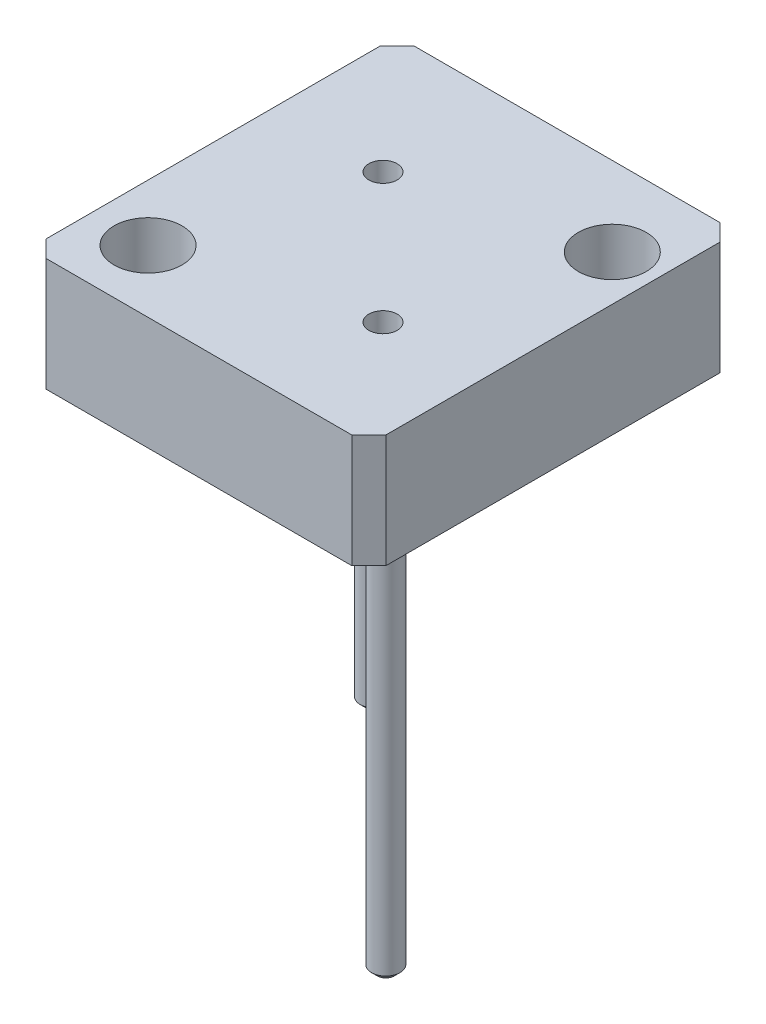
ISO-10303-21;
HEADER;
FILE_DESCRIPTION(('STEP AP214'),'2;1');
FILE_NAME('part.step','',(''),(''),'','','');
FILE_SCHEMA(('AUTOMOTIVE_DESIGN { 1 0 10303 214 1 1 1 1 }'));
ENDSEC;
DATA;
#1=APPLICATION_CONTEXT('core data for automotive mechanical design processes');
#2=APPLICATION_PROTOCOL_DEFINITION('international standard','automotive_design',2000,#1);
#3=PRODUCT_CONTEXT('',#1,'mechanical');
#4=PRODUCT('Part','Part','',(#3));
#5=PRODUCT_RELATED_PRODUCT_CATEGORY('part','',(#4));
#6=PRODUCT_DEFINITION_FORMATION('','',#4);
#7=PRODUCT_DEFINITION_CONTEXT('part definition',#1,'design');
#8=PRODUCT_DEFINITION('design','',#6,#7);
#9=PRODUCT_DEFINITION_SHAPE('','',#8);
#10=(LENGTH_UNIT() NAMED_UNIT(*) SI_UNIT(.MILLI.,.METRE.));
#11=(NAMED_UNIT(*) PLANE_ANGLE_UNIT() SI_UNIT($,.RADIAN.));
#12=(NAMED_UNIT(*) SI_UNIT($,.STERADIAN.) SOLID_ANGLE_UNIT());
#13=UNCERTAINTY_MEASURE_WITH_UNIT(LENGTH_MEASURE(1.E-05),#10,'distance_accuracy_value','');
#14=(GEOMETRIC_REPRESENTATION_CONTEXT(3) GLOBAL_UNCERTAINTY_ASSIGNED_CONTEXT((#13)) GLOBAL_UNIT_ASSIGNED_CONTEXT((#10,
#11,#12)) REPRESENTATION_CONTEXT('',''));
#15=CARTESIAN_POINT('',(0.,0.,0.));
#16=DIRECTION('',(0.,0.,1.));
#17=DIRECTION('',(1.,0.,0.));
#18=AXIS2_PLACEMENT_3D('',#15,#16,#17);
#19=CARTESIAN_POINT('',(0.,20.,0.));
#20=DIRECTION('',(1.,0.,0.));
#21=DIRECTION('',(0.,0.,-1.));
#22=AXIS2_PLACEMENT_3D('',#19,#20,#21);
#23=PLANE('',#22);
#24=DIRECTION('',(0.,0.,1.));
#25=VECTOR('',#24,1.);
#26=CARTESIAN_POINT('',(0.,0.,0.));
#27=LINE('',#26,#25);
#28=CARTESIAN_POINT('',(0.,0.,-62.));
#29=VERTEX_POINT('',#28);
#30=CARTESIAN_POINT('',(0.,0.,-3.00000000000002));
#31=VERTEX_POINT('',#30);
#32=EDGE_CURVE('E184',#29,#31,#27,.T.);
#33=ORIENTED_EDGE('',*,*,#32,.T.);
#34=DIRECTION('',(0.,1.,0.));
#35=VECTOR('',#34,1.);
#36=CARTESIAN_POINT('',(0.,20.,-3.00000000000002));
#37=LINE('',#36,#35);
#38=CARTESIAN_POINT('',(0.,20.,-3.00000000000002));
#39=VERTEX_POINT('',#38);
#40=EDGE_CURVE('E11',#31,#39,#37,.T.);
#41=ORIENTED_EDGE('',*,*,#40,.T.);
#42=DIRECTION('',(0.,0.,1.));
#43=VECTOR('',#42,1.);
#44=CARTESIAN_POINT('',(0.,20.,0.));
#45=LINE('',#44,#43);
#46=CARTESIAN_POINT('',(0.,20.,-62.));
#47=VERTEX_POINT('',#46);
#48=EDGE_CURVE('E134',#47,#39,#45,.T.);
#49=ORIENTED_EDGE('',*,*,#48,.F.);
#50=DIRECTION('',(0.,-1.,0.));
#51=VECTOR('',#50,1.);
#52=CARTESIAN_POINT('',(0.,20.,-62.));
#53=LINE('',#52,#51);
#54=EDGE_CURVE('E50',#47,#29,#53,.T.);
#55=ORIENTED_EDGE('',*,*,#54,.T.);
#56=EDGE_LOOP('',(#33,#41,#49,#55));
#57=FACE_BOUND('',#56,.T.);
#58=ADVANCED_FACE('F41',(#57),#23,.F.);
#59=CARTESIAN_POINT('',(0.,20.,0.));
#60=DIRECTION('',(0.,0.,-1.));
#61=DIRECTION('',(-1.,0.,0.));
#62=AXIS2_PLACEMENT_3D('',#59,#60,#61);
#63=PLANE('',#62);
#64=DIRECTION('',(1.,0.,0.));
#65=VECTOR('',#64,1.);
#66=CARTESIAN_POINT('',(0.,0.,0.));
#67=LINE('',#66,#65);
#68=CARTESIAN_POINT('',(3.,0.,0.));
#69=VERTEX_POINT('',#68);
#70=CARTESIAN_POINT('',(57.,0.,0.));
#71=VERTEX_POINT('',#70);
#72=EDGE_CURVE('E139',#69,#71,#67,.T.);
#73=ORIENTED_EDGE('',*,*,#72,.T.);
#74=DIRECTION('',(0.,1.,0.));
#75=VECTOR('',#74,1.);
#76=CARTESIAN_POINT('',(57.,20.,0.));
#77=LINE('',#76,#75);
#78=CARTESIAN_POINT('',(57.,20.,0.));
#79=VERTEX_POINT('',#78);
#80=EDGE_CURVE('E57',#71,#79,#77,.T.);
#81=ORIENTED_EDGE('',*,*,#80,.T.);
#82=DIRECTION('',(1.,0.,0.));
#83=VECTOR('',#82,1.);
#84=CARTESIAN_POINT('',(0.,20.,0.));
#85=LINE('',#84,#83);
#86=CARTESIAN_POINT('',(3.,20.,0.));
#87=VERTEX_POINT('',#86);
#88=EDGE_CURVE('E137',#87,#79,#85,.T.);
#89=ORIENTED_EDGE('',*,*,#88,.F.);
#90=DIRECTION('',(0.,-1.,0.));
#91=VECTOR('',#90,1.);
#92=CARTESIAN_POINT('',(3.,20.,0.));
#93=LINE('',#92,#91);
#94=EDGE_CURVE('E176',#87,#69,#93,.T.);
#95=ORIENTED_EDGE('',*,*,#94,.T.);
#96=EDGE_LOOP('',(#73,#81,#89,#95));
#97=FACE_BOUND('',#96,.T.);
#98=ADVANCED_FACE('F246',(#97),#63,.F.);
#99=CARTESIAN_POINT('',(60.,20.,0.));
#100=DIRECTION('',(-1.,0.,0.));
#101=DIRECTION('',(0.,0.,1.));
#102=AXIS2_PLACEMENT_3D('',#99,#100,#101);
#103=PLANE('',#102);
#104=DIRECTION('',(0.,0.,-1.));
#105=VECTOR('',#104,1.);
#106=CARTESIAN_POINT('',(60.,0.,0.));
#107=LINE('',#106,#105);
#108=CARTESIAN_POINT('',(60.,0.,-2.99999999999997));
#109=VERTEX_POINT('',#108);
#110=CARTESIAN_POINT('',(60.,0.,-62.));
#111=VERTEX_POINT('',#110);
#112=EDGE_CURVE('E135',#109,#111,#107,.T.);
#113=ORIENTED_EDGE('',*,*,#112,.T.);
#114=DIRECTION('',(0.,1.,0.));
#115=VECTOR('',#114,1.);
#116=CARTESIAN_POINT('',(60.,20.,-62.));
#117=LINE('',#116,#115);
#118=CARTESIAN_POINT('',(60.,20.,-62.));
#119=VERTEX_POINT('',#118);
#120=EDGE_CURVE('E113',#111,#119,#117,.T.);
#121=ORIENTED_EDGE('',*,*,#120,.T.);
#122=DIRECTION('',(0.,0.,-1.));
#123=VECTOR('',#122,1.);
#124=CARTESIAN_POINT('',(60.,20.,0.));
#125=LINE('',#124,#123);
#126=CARTESIAN_POINT('',(60.,20.,-2.99999999999997));
#127=VERTEX_POINT('',#126);
#128=EDGE_CURVE('E196',#127,#119,#125,.T.);
#129=ORIENTED_EDGE('',*,*,#128,.F.);
#130=DIRECTION('',(0.,-1.,0.));
#131=VECTOR('',#130,1.);
#132=CARTESIAN_POINT('',(60.,20.,-2.99999999999997));
#133=LINE('',#132,#131);
#134=EDGE_CURVE('E118',#127,#109,#133,.T.);
#135=ORIENTED_EDGE('',*,*,#134,.T.);
#136=EDGE_LOOP('',(#113,#121,#129,#135));
#137=FACE_BOUND('',#136,.T.);
#138=ADVANCED_FACE('F243',(#137),#103,.F.);
#139=CARTESIAN_POINT('',(0.,20.,-65.));
#140=DIRECTION('',(0.,0.,1.));
#141=DIRECTION('',(1.,0.,0.));
#142=AXIS2_PLACEMENT_3D('',#139,#140,#141);
#143=PLANE('',#142);
#144=DIRECTION('',(-1.,0.,0.));
#145=VECTOR('',#144,1.);
#146=CARTESIAN_POINT('',(0.,20.,-65.));
#147=LINE('',#146,#145);
#148=CARTESIAN_POINT('',(57.,20.,-65.));
#149=VERTEX_POINT('',#148);
#150=CARTESIAN_POINT('',(3.00000000000002,20.,-65.));
#151=VERTEX_POINT('',#150);
#152=EDGE_CURVE('E128',#149,#151,#147,.T.);
#153=ORIENTED_EDGE('',*,*,#152,.F.);
#154=DIRECTION('',(0.,-1.,0.));
#155=VECTOR('',#154,1.);
#156=CARTESIAN_POINT('',(57.,20.,-65.));
#157=LINE('',#156,#155);
#158=CARTESIAN_POINT('',(57.,0.,-65.));
#159=VERTEX_POINT('',#158);
#160=EDGE_CURVE('E112',#149,#159,#157,.T.);
#161=ORIENTED_EDGE('',*,*,#160,.T.);
#162=DIRECTION('',(-1.,0.,0.));
#163=VECTOR('',#162,1.);
#164=CARTESIAN_POINT('',(0.,0.,-65.));
#165=LINE('',#164,#163);
#166=CARTESIAN_POINT('',(3.00000000000002,0.,-65.));
#167=VERTEX_POINT('',#166);
#168=EDGE_CURVE('E125',#159,#167,#165,.T.);
#169=ORIENTED_EDGE('',*,*,#168,.T.);
#170=DIRECTION('',(0.,1.,0.));
#171=VECTOR('',#170,1.);
#172=CARTESIAN_POINT('',(3.00000000000002,20.,-65.));
#173=LINE('',#172,#171);
#174=EDGE_CURVE('E130',#167,#151,#173,.T.);
#175=ORIENTED_EDGE('',*,*,#174,.T.);
#176=EDGE_LOOP('',(#153,#161,#169,#175));
#177=FACE_BOUND('',#176,.T.);
#178=ADVANCED_FACE('F124',(#177),#143,.F.);
#179=CARTESIAN_POINT('',(0.,20.,0.));
#180=DIRECTION('',(0.,-1.,0.));
#181=DIRECTION('',(0.,0.,-1.));
#182=AXIS2_PLACEMENT_3D('',#179,#180,#181);
#183=PLANE('',#182);
#184=CARTESIAN_POINT('',(19.5,20.,-43.));
#185=DIRECTION('',(0.,1.,0.));
#186=DIRECTION('',(0.,0.,1.));
#187=AXIS2_PLACEMENT_3D('',#184,#185,#186);
#188=CIRCLE('',#187,2.5);
#189=CARTESIAN_POINT('',(19.5,20.,-40.5));
#190=VERTEX_POINT('',#189);
#191=EDGE_CURVE('E215',#190,#190,#188,.T.);
#192=ORIENTED_EDGE('',*,*,#191,.F.);
#193=EDGE_LOOP('',(#192));
#194=FACE_BOUND('',#193,.T.);
#195=CARTESIAN_POINT('',(42.5,20.,-20.));
#196=DIRECTION('',(0.,1.,0.));
#197=DIRECTION('',(0.,0.,1.));
#198=AXIS2_PLACEMENT_3D('',#195,#196,#197);
#199=CIRCLE('',#198,2.5);
#200=CARTESIAN_POINT('',(42.5,20.,-17.5));
#201=VERTEX_POINT('',#200);
#202=EDGE_CURVE('E212',#201,#201,#199,.T.);
#203=ORIENTED_EDGE('',*,*,#202,.F.);
#204=EDGE_LOOP('',(#203));
#205=FACE_BOUND('',#204,.T.);
#206=CARTESIAN_POINT('',(52.,20.,-51.));
#207=DIRECTION('',(0.,1.,0.));
#208=DIRECTION('',(0.,0.,1.));
#209=AXIS2_PLACEMENT_3D('',#206,#207,#208);
#210=CIRCLE('',#209,6.00000000000001);
#211=CARTESIAN_POINT('',(52.,20.,-45.));
#212=VERTEX_POINT('',#211);
#213=EDGE_CURVE('E192',#212,#212,#210,.T.);
#214=ORIENTED_EDGE('',*,*,#213,.F.);
#215=EDGE_LOOP('',(#214));
#216=FACE_BOUND('',#215,.T.);
#217=CARTESIAN_POINT('',(10.,20.,-11.));
#218=DIRECTION('',(0.,1.,0.));
#219=DIRECTION('',(0.,0.,1.));
#220=AXIS2_PLACEMENT_3D('',#217,#218,#219);
#221=CIRCLE('',#220,6.);
#222=CARTESIAN_POINT('',(10.,20.,-5.));
#223=VERTEX_POINT('',#222);
#224=EDGE_CURVE('E200',#223,#223,#221,.T.);
#225=ORIENTED_EDGE('',*,*,#224,.F.);
#226=EDGE_LOOP('',(#225));
#227=FACE_BOUND('',#226,.T.);
#228=ORIENTED_EDGE('',*,*,#128,.T.);
#229=DIRECTION('',(0.707106781186548,0.,0.707106781186548));
#230=VECTOR('',#229,1.);
#231=CARTESIAN_POINT('',(57.,20.,-65.));
#232=LINE('',#231,#230);
#233=EDGE_CURVE('E174',#119,#149,#232,.F.);
#234=ORIENTED_EDGE('',*,*,#233,.T.);
#235=ORIENTED_EDGE('',*,*,#152,.T.);
#236=DIRECTION('',(0.707106781186549,0.,-0.707106781186546));
#237=VECTOR('',#236,1.);
#238=CARTESIAN_POINT('',(0.,20.,-62.));
#239=LINE('',#238,#237);
#240=EDGE_CURVE('E169',#151,#47,#239,.F.);
#241=ORIENTED_EDGE('',*,*,#240,.T.);
#242=ORIENTED_EDGE('',*,*,#48,.T.);
#243=DIRECTION('',(-0.707106781186546,0.,-0.707106781186549));
#244=VECTOR('',#243,1.);
#245=CARTESIAN_POINT('',(3.,20.,0.));
#246=LINE('',#245,#244);
#247=EDGE_CURVE('E64',#39,#87,#246,.F.);
#248=ORIENTED_EDGE('',*,*,#247,.T.);
#249=ORIENTED_EDGE('',*,*,#88,.T.);
#250=DIRECTION('',(-0.707106781186549,0.,0.707106781186546));
#251=VECTOR('',#250,1.);
#252=CARTESIAN_POINT('',(60.,20.,-2.99999999999998));
#253=LINE('',#252,#251);
#254=EDGE_CURVE('E172',#79,#127,#253,.F.);
#255=ORIENTED_EDGE('',*,*,#254,.T.);
#256=EDGE_LOOP('',(#228,#234,#235,#241,#242,#248,#249,#255));
#257=FACE_BOUND('',#256,.T.);
#258=ADVANCED_FACE('F230',(#194,#205,#216,#227,#257),#183,.F.);
#259=CARTESIAN_POINT('',(0.,0.,0.));
#260=DIRECTION('',(0.,-1.,0.));
#261=DIRECTION('',(0.,0.,-1.));
#262=AXIS2_PLACEMENT_3D('',#259,#260,#261);
#263=PLANE('',#262);
#264=CARTESIAN_POINT('',(10.,0.,-51.));
#265=DIRECTION('',(0.,-1.,0.));
#266=DIRECTION('',(0.,0.,-1.));
#267=AXIS2_PLACEMENT_3D('',#264,#265,#266);
#268=CIRCLE('',#267,2.5);
#269=CARTESIAN_POINT('',(10.,0.,-53.5));
#270=VERTEX_POINT('',#269);
#271=EDGE_CURVE('E146',#270,#270,#268,.T.);
#272=ORIENTED_EDGE('',*,*,#271,.F.);
#273=EDGE_LOOP('',(#272));
#274=FACE_BOUND('',#273,.T.);
#275=CARTESIAN_POINT('',(52.,0.,-11.));
#276=DIRECTION('',(0.,-1.,0.));
#277=DIRECTION('',(0.,0.,-1.));
#278=AXIS2_PLACEMENT_3D('',#275,#276,#277);
#279=CIRCLE('',#278,2.5);
#280=CARTESIAN_POINT('',(52.,0.,-13.5));
#281=VERTEX_POINT('',#280);
#282=EDGE_CURVE('E143',#281,#281,#279,.T.);
#283=ORIENTED_EDGE('',*,*,#282,.F.);
#284=EDGE_LOOP('',(#283));
#285=FACE_BOUND('',#284,.T.);
#286=CARTESIAN_POINT('',(52.,0.,-51.));
#287=DIRECTION('',(0.,1.,0.));
#288=DIRECTION('',(0.,0.,1.));
#289=AXIS2_PLACEMENT_3D('',#286,#287,#288);
#290=CIRCLE('',#289,6.00000000000001);
#291=CARTESIAN_POINT('',(52.,0.,-45.));
#292=VERTEX_POINT('',#291);
#293=EDGE_CURVE('E189',#292,#292,#290,.T.);
#294=ORIENTED_EDGE('',*,*,#293,.T.);
#295=EDGE_LOOP('',(#294));
#296=FACE_BOUND('',#295,.T.);
#297=CARTESIAN_POINT('',(10.,0.,-11.));
#298=DIRECTION('',(0.,1.,0.));
#299=DIRECTION('',(0.,0.,1.));
#300=AXIS2_PLACEMENT_3D('',#297,#298,#299);
#301=CIRCLE('',#300,6.);
#302=CARTESIAN_POINT('',(10.,0.,-5.));
#303=VERTEX_POINT('',#302);
#304=EDGE_CURVE('E203',#303,#303,#301,.T.);
#305=ORIENTED_EDGE('',*,*,#304,.T.);
#306=EDGE_LOOP('',(#305));
#307=FACE_BOUND('',#306,.T.);
#308=ORIENTED_EDGE('',*,*,#168,.F.);
#309=DIRECTION('',(-0.707106781186548,0.,-0.707106781186548));
#310=VECTOR('',#309,1.);
#311=CARTESIAN_POINT('',(61.,0.,-61.));
#312=LINE('',#311,#310);
#313=EDGE_CURVE('E108',#159,#111,#312,.F.);
#314=ORIENTED_EDGE('',*,*,#313,.T.);
#315=ORIENTED_EDGE('',*,*,#112,.F.);
#316=DIRECTION('',(0.707106781186549,0.,-0.707106781186546));
#317=VECTOR('',#316,1.);
#318=CARTESIAN_POINT('',(28.4999999999999,0.,28.5));
#319=LINE('',#318,#317);
#320=EDGE_CURVE('E119',#109,#71,#319,.F.);
#321=ORIENTED_EDGE('',*,*,#320,.T.);
#322=ORIENTED_EDGE('',*,*,#72,.F.);
#323=DIRECTION('',(0.707106781186546,0.,0.707106781186549));
#324=VECTOR('',#323,1.);
#325=CARTESIAN_POINT('',(1.50000000000001,0.,-1.5));
#326=LINE('',#325,#324);
#327=EDGE_CURVE('E163',#69,#31,#326,.F.);
#328=ORIENTED_EDGE('',*,*,#327,.T.);
#329=ORIENTED_EDGE('',*,*,#32,.F.);
#330=DIRECTION('',(-0.707106781186549,0.,0.707106781186546));
#331=VECTOR('',#330,1.);
#332=CARTESIAN_POINT('',(-31.,0.,-31.0000000000001));
#333=LINE('',#332,#331);
#334=EDGE_CURVE('E129',#29,#167,#333,.F.);
#335=ORIENTED_EDGE('',*,*,#334,.T.);
#336=EDGE_LOOP('',(#308,#314,#315,#321,#322,#328,#329,#335));
#337=FACE_BOUND('',#336,.T.);
#338=ADVANCED_FACE('F132',(#274,#285,#296,#307,#337),#263,.T.);
#339=CARTESIAN_POINT('',(10.,0.,-11.));
#340=DIRECTION('',(0.,1.,0.));
#341=DIRECTION('',(0.,0.,1.));
#342=AXIS2_PLACEMENT_3D('',#339,#340,#341);
#343=CYLINDRICAL_SURFACE('',#342,6.);
#344=ORIENTED_EDGE('',*,*,#304,.F.);
#345=EDGE_LOOP('',(#344));
#346=FACE_BOUND('',#345,.T.);
#347=ORIENTED_EDGE('',*,*,#224,.T.);
#348=EDGE_LOOP('',(#347));
#349=FACE_BOUND('',#348,.T.);
#350=ADVANCED_FACE('F410',(#346,#349),#343,.F.);
#351=CARTESIAN_POINT('',(52.,0.,-51.));
#352=DIRECTION('',(0.,1.,0.));
#353=DIRECTION('',(0.,0.,1.));
#354=AXIS2_PLACEMENT_3D('',#351,#352,#353);
#355=CYLINDRICAL_SURFACE('',#354,6.00000000000001);
#356=ORIENTED_EDGE('',*,*,#293,.F.);
#357=EDGE_LOOP('',(#356));
#358=FACE_BOUND('',#357,.T.);
#359=ORIENTED_EDGE('',*,*,#213,.T.);
#360=EDGE_LOOP('',(#359));
#361=FACE_BOUND('',#360,.T.);
#362=ADVANCED_FACE('F400',(#358,#361),#355,.F.);
#363=CARTESIAN_POINT('',(42.5,15.,-20.));
#364=DIRECTION('',(0.,1.,0.));
#365=DIRECTION('',(0.,0.,1.));
#366=AXIS2_PLACEMENT_3D('',#363,#364,#365);
#367=CYLINDRICAL_SURFACE('',#366,2.5);
#368=CARTESIAN_POINT('',(42.5,15.,-20.));
#369=DIRECTION('',(0.,1.,0.));
#370=DIRECTION('',(0.,0.,1.));
#371=AXIS2_PLACEMENT_3D('',#368,#369,#370);
#372=CIRCLE('',#371,2.5);
#373=CARTESIAN_POINT('',(42.5,15.,-17.5));
#374=VERTEX_POINT('',#373);
#375=EDGE_CURVE('E209',#374,#374,#372,.T.);
#376=ORIENTED_EDGE('',*,*,#375,.F.);
#377=EDGE_LOOP('',(#376));
#378=FACE_BOUND('',#377,.T.);
#379=ORIENTED_EDGE('',*,*,#202,.T.);
#380=EDGE_LOOP('',(#379));
#381=FACE_BOUND('',#380,.T.);
#382=ADVANCED_FACE('F390',(#378,#381),#367,.F.);
#383=CARTESIAN_POINT('',(42.5,15.,-20.));
#384=DIRECTION('',(0.,1.,0.));
#385=DIRECTION('',(0.,0.,1.));
#386=AXIS2_PLACEMENT_3D('',#383,#384,#385);
#387=PLANE('',#386);
#388=ORIENTED_EDGE('',*,*,#375,.T.);
#389=EDGE_LOOP('',(#388));
#390=FACE_BOUND('',#389,.T.);
#391=ADVANCED_FACE('F226',(#390),#387,.T.);
#392=CARTESIAN_POINT('',(19.5,15.,-43.));
#393=DIRECTION('',(0.,1.,0.));
#394=DIRECTION('',(0.,0.,1.));
#395=AXIS2_PLACEMENT_3D('',#392,#393,#394);
#396=CYLINDRICAL_SURFACE('',#395,2.5);
#397=CARTESIAN_POINT('',(19.5,15.,-43.));
#398=DIRECTION('',(0.,1.,0.));
#399=DIRECTION('',(0.,0.,1.));
#400=AXIS2_PLACEMENT_3D('',#397,#398,#399);
#401=CIRCLE('',#400,2.5);
#402=CARTESIAN_POINT('',(19.5,15.,-40.5));
#403=VERTEX_POINT('',#402);
#404=EDGE_CURVE('E204',#403,#403,#401,.T.);
#405=ORIENTED_EDGE('',*,*,#404,.F.);
#406=EDGE_LOOP('',(#405));
#407=FACE_BOUND('',#406,.T.);
#408=ORIENTED_EDGE('',*,*,#191,.T.);
#409=EDGE_LOOP('',(#408));
#410=FACE_BOUND('',#409,.T.);
#411=ADVANCED_FACE('F223',(#407,#410),#396,.F.);
#412=CARTESIAN_POINT('',(19.5,15.,-43.));
#413=DIRECTION('',(0.,1.,0.));
#414=DIRECTION('',(0.,0.,1.));
#415=AXIS2_PLACEMENT_3D('',#412,#413,#414);
#416=PLANE('',#415);
#417=ORIENTED_EDGE('',*,*,#404,.T.);
#418=EDGE_LOOP('',(#417));
#419=FACE_BOUND('',#418,.T.);
#420=ADVANCED_FACE('F221',(#419),#416,.T.);
#421=CARTESIAN_POINT('',(52.,-70.,-11.));
#422=DIRECTION('',(0.,1.,0.));
#423=DIRECTION('',(0.,0.,1.));
#424=AXIS2_PLACEMENT_3D('',#421,#422,#423);
#425=CYLINDRICAL_SURFACE('',#424,2.5);
#426=CARTESIAN_POINT('',(52.,-68.9999999999999,-11.));
#427=DIRECTION('',(0.,1.,0.));
#428=DIRECTION('',(0.,0.,1.));
#429=AXIS2_PLACEMENT_3D('',#426,#427,#428);
#430=CIRCLE('',#429,2.5);
#431=CARTESIAN_POINT('',(52.,-68.9999999999999,-8.5));
#432=VERTEX_POINT('',#431);
#433=EDGE_CURVE('E149',#432,#432,#430,.T.);
#434=ORIENTED_EDGE('',*,*,#433,.T.);
#435=EDGE_LOOP('',(#434));
#436=FACE_BOUND('',#435,.T.);
#437=ORIENTED_EDGE('',*,*,#282,.T.);
#438=EDGE_LOOP('',(#437));
#439=FACE_BOUND('',#438,.T.);
#440=ADVANCED_FACE('F357',(#436,#439),#425,.T.);
#441=CARTESIAN_POINT('',(0.,-70.,0.));
#442=DIRECTION('',(0.,1.,0.));
#443=DIRECTION('',(0.,0.,1.));
#444=AXIS2_PLACEMENT_3D('',#441,#442,#443);
#445=PLANE('',#444);
#446=CARTESIAN_POINT('',(52.,-70.,-11.));
#447=DIRECTION('',(0.,1.,0.));
#448=DIRECTION('',(0.,0.,1.));
#449=AXIS2_PLACEMENT_3D('',#446,#447,#448);
#450=CIRCLE('',#449,1.4999999999999);
#451=CARTESIAN_POINT('',(52.,-70.,-9.5000000000001));
#452=VERTEX_POINT('',#451);
#453=EDGE_CURVE('E152',#452,#452,#450,.F.);
#454=ORIENTED_EDGE('',*,*,#453,.T.);
#455=EDGE_LOOP('',(#454));
#456=FACE_BOUND('',#455,.T.);
#457=ADVANCED_FACE('F347',(#456),#445,.F.);
#458=CARTESIAN_POINT('',(10.,-70.,-51.));
#459=DIRECTION('',(0.,1.,0.));
#460=DIRECTION('',(0.,0.,1.));
#461=AXIS2_PLACEMENT_3D('',#458,#459,#460);
#462=CYLINDRICAL_SURFACE('',#461,2.5);
#463=CARTESIAN_POINT('',(10.,-68.9999999999999,-51.));
#464=DIRECTION('',(0.,1.,0.));
#465=DIRECTION('',(0.,0.,1.));
#466=AXIS2_PLACEMENT_3D('',#463,#464,#465);
#467=CIRCLE('',#466,2.5);
#468=CARTESIAN_POINT('',(10.,-68.9999999999999,-48.5));
#469=VERTEX_POINT('',#468);
#470=EDGE_CURVE('E155',#469,#469,#467,.T.);
#471=ORIENTED_EDGE('',*,*,#470,.T.);
#472=EDGE_LOOP('',(#471));
#473=FACE_BOUND('',#472,.T.);
#474=ORIENTED_EDGE('',*,*,#271,.T.);
#475=EDGE_LOOP('',(#474));
#476=FACE_BOUND('',#475,.T.);
#477=ADVANCED_FACE('F337',(#473,#476),#462,.T.);
#478=CARTESIAN_POINT('',(10.,-70.,-51.));
#479=DIRECTION('',(0.,1.,0.));
#480=DIRECTION('',(0.,0.,1.));
#481=AXIS2_PLACEMENT_3D('',#478,#479,#480);
#482=PLANE('',#481);
#483=CARTESIAN_POINT('',(10.,-70.,-51.));
#484=DIRECTION('',(0.,1.,0.));
#485=DIRECTION('',(0.,0.,1.));
#486=AXIS2_PLACEMENT_3D('',#483,#484,#485);
#487=CIRCLE('',#486,1.49999999999992);
#488=CARTESIAN_POINT('',(10.,-70.,-49.5000000000001));
#489=VERTEX_POINT('',#488);
#490=EDGE_CURVE('E158',#489,#489,#487,.F.);
#491=ORIENTED_EDGE('',*,*,#490,.T.);
#492=EDGE_LOOP('',(#491));
#493=FACE_BOUND('',#492,.T.);
#494=ADVANCED_FACE('F270',(#493),#482,.F.);
#495=CARTESIAN_POINT('',(52.,-68.9999999999999,-11.));
#496=DIRECTION('',(0.,1.,0.));
#497=DIRECTION('',(0.,0.,1.));
#498=AXIS2_PLACEMENT_3D('',#495,#496,#497);
#499=CONICAL_SURFACE('',#498,2.5,0.785398163397448);
#500=ORIENTED_EDGE('',*,*,#453,.F.);
#501=EDGE_LOOP('',(#500));
#502=FACE_BOUND('',#501,.T.);
#503=ORIENTED_EDGE('',*,*,#433,.F.);
#504=EDGE_LOOP('',(#503));
#505=FACE_BOUND('',#504,.T.);
#506=ADVANCED_FACE('F263',(#502,#505),#499,.T.);
#507=CARTESIAN_POINT('',(10.,-68.9999999999999,-51.));
#508=DIRECTION('',(0.,1.,0.));
#509=DIRECTION('',(0.,0.,1.));
#510=AXIS2_PLACEMENT_3D('',#507,#508,#509);
#511=CONICAL_SURFACE('',#510,2.5,0.785398163397441);
#512=ORIENTED_EDGE('',*,*,#490,.F.);
#513=EDGE_LOOP('',(#512));
#514=FACE_BOUND('',#513,.T.);
#515=ORIENTED_EDGE('',*,*,#470,.F.);
#516=EDGE_LOOP('',(#515));
#517=FACE_BOUND('',#516,.T.);
#518=ADVANCED_FACE('F269',(#514,#517),#511,.T.);
#519=CARTESIAN_POINT('',(57.,20.,-65.));
#520=DIRECTION('',(-0.707106781186547,0.,0.707106781186547));
#521=DIRECTION('',(0.,-1.,0.));
#522=AXIS2_PLACEMENT_3D('',#519,#520,#521);
#523=PLANE('',#522);
#524=ORIENTED_EDGE('',*,*,#233,.F.);
#525=ORIENTED_EDGE('',*,*,#120,.F.);
#526=ORIENTED_EDGE('',*,*,#313,.F.);
#527=ORIENTED_EDGE('',*,*,#160,.F.);
#528=EDGE_LOOP('',(#524,#525,#526,#527));
#529=FACE_BOUND('',#528,.T.);
#530=ADVANCED_FACE('F111',(#529),#523,.F.);
#531=CARTESIAN_POINT('',(60.,20.,-2.99999999999998));
#532=DIRECTION('',(-0.707106781186546,0.,-0.707106781186549));
#533=DIRECTION('',(0.,-1.,0.));
#534=AXIS2_PLACEMENT_3D('',#531,#532,#533);
#535=PLANE('',#534);
#536=ORIENTED_EDGE('',*,*,#254,.F.);
#537=ORIENTED_EDGE('',*,*,#80,.F.);
#538=ORIENTED_EDGE('',*,*,#320,.F.);
#539=ORIENTED_EDGE('',*,*,#134,.F.);
#540=EDGE_LOOP('',(#536,#537,#538,#539));
#541=FACE_BOUND('',#540,.T.);
#542=ADVANCED_FACE('F245',(#541),#535,.F.);
#543=CARTESIAN_POINT('',(3.,20.,0.));
#544=DIRECTION('',(0.707106781186549,0.,-0.707106781186546));
#545=DIRECTION('',(0.,-1.,0.));
#546=AXIS2_PLACEMENT_3D('',#543,#544,#545);
#547=PLANE('',#546);
#548=ORIENTED_EDGE('',*,*,#247,.F.);
#549=ORIENTED_EDGE('',*,*,#40,.F.);
#550=ORIENTED_EDGE('',*,*,#327,.F.);
#551=ORIENTED_EDGE('',*,*,#94,.F.);
#552=EDGE_LOOP('',(#548,#549,#550,#551));
#553=FACE_BOUND('',#552,.T.);
#554=ADVANCED_FACE('F249',(#553),#547,.F.);
#555=CARTESIAN_POINT('',(0.,20.,-62.));
#556=DIRECTION('',(0.707106781186546,0.,0.707106781186549));
#557=DIRECTION('',(0.,-1.,0.));
#558=AXIS2_PLACEMENT_3D('',#555,#556,#557);
#559=PLANE('',#558);
#560=ORIENTED_EDGE('',*,*,#240,.F.);
#561=ORIENTED_EDGE('',*,*,#174,.F.);
#562=ORIENTED_EDGE('',*,*,#334,.F.);
#563=ORIENTED_EDGE('',*,*,#54,.F.);
#564=EDGE_LOOP('',(#560,#561,#562,#563));
#565=FACE_BOUND('',#564,.T.);
#566=ADVANCED_FACE('F44',(#565),#559,.F.);
#567=CLOSED_SHELL('',(#58,#98,#138,#178,#258,#338,#350,#362,#382,#391,#411,#420,#440,#457,#477,
#494,#506,#518,#530,#542,#554,#566));
#568=MANIFOLD_SOLID_BREP('B2',#567);
#569=ADVANCED_BREP_SHAPE_REPRESENTATION('',(#18,#568),#14);
#570=SHAPE_DEFINITION_REPRESENTATION(#9,#569);
ENDSEC;
END-ISO-10303-21;
